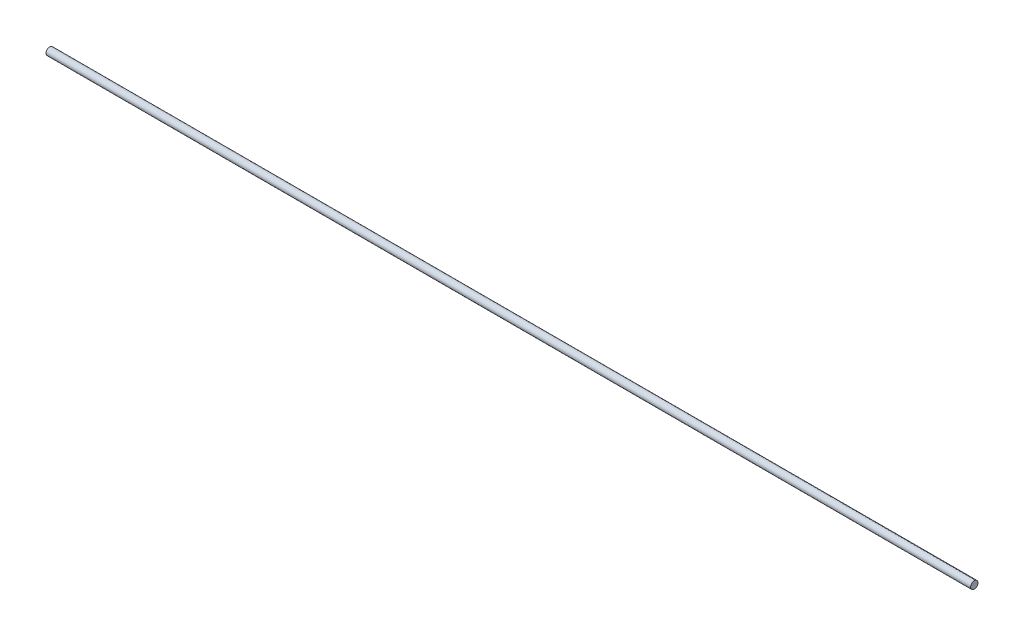
ISO-10303-21;
HEADER;
FILE_DESCRIPTION(('STEP AP214'),'2;1');
FILE_NAME('part.step','',(''),(''),'','','');
FILE_SCHEMA(('AUTOMOTIVE_DESIGN { 1 0 10303 214 1 1 1 1 }'));
ENDSEC;
DATA;
#1=APPLICATION_CONTEXT('core data for automotive mechanical design processes');
#2=APPLICATION_PROTOCOL_DEFINITION('international standard','automotive_design',2000,#1);
#3=PRODUCT_CONTEXT('',#1,'mechanical');
#4=PRODUCT('Part','Part','',(#3));
#5=PRODUCT_RELATED_PRODUCT_CATEGORY('part','',(#4));
#6=PRODUCT_DEFINITION_FORMATION('','',#4);
#7=PRODUCT_DEFINITION_CONTEXT('part definition',#1,'design');
#8=PRODUCT_DEFINITION('design','',#6,#7);
#9=PRODUCT_DEFINITION_SHAPE('','',#8);
#10=(LENGTH_UNIT() NAMED_UNIT(*) SI_UNIT(.MILLI.,.METRE.));
#11=(NAMED_UNIT(*) PLANE_ANGLE_UNIT() SI_UNIT($,.RADIAN.));
#12=(NAMED_UNIT(*) SI_UNIT($,.STERADIAN.) SOLID_ANGLE_UNIT());
#13=UNCERTAINTY_MEASURE_WITH_UNIT(LENGTH_MEASURE(1.E-05),#10,'distance_accuracy_value','');
#14=(GEOMETRIC_REPRESENTATION_CONTEXT(3) GLOBAL_UNCERTAINTY_ASSIGNED_CONTEXT((#13)) GLOBAL_UNIT_ASSIGNED_CONTEXT((#10,
#11,#12)) REPRESENTATION_CONTEXT('',''));
#15=CARTESIAN_POINT('',(0.,0.,0.));
#16=DIRECTION('',(0.,0.,1.));
#17=DIRECTION('',(1.,0.,0.));
#18=AXIS2_PLACEMENT_3D('',#15,#16,#17);
#19=CARTESIAN_POINT('',(500.,0.,0.));
#20=DIRECTION('',(-1.,0.,0.));
#21=DIRECTION('',(0.,0.,1.));
#22=AXIS2_PLACEMENT_3D('',#19,#20,#21);
#23=CYLINDRICAL_SURFACE('',#22,2.);
#24=CARTESIAN_POINT('',(500.,0.,0.));
#25=DIRECTION('',(1.,0.,0.));
#26=DIRECTION('',(0.,0.,-1.));
#27=AXIS2_PLACEMENT_3D('',#24,#25,#26);
#28=CIRCLE('',#27,2.);
#29=CARTESIAN_POINT('',(500.,0.,-2.));
#30=VERTEX_POINT('',#29);
#31=EDGE_CURVE('E10',#30,#30,#28,.T.);
#32=ORIENTED_EDGE('',*,*,#31,.F.);
#33=EDGE_LOOP('',(#32));
#34=FACE_BOUND('',#33,.T.);
#35=CARTESIAN_POINT('',(0.,0.,0.));
#36=DIRECTION('',(1.,0.,0.));
#37=DIRECTION('',(0.,0.,-1.));
#38=AXIS2_PLACEMENT_3D('',#35,#36,#37);
#39=CIRCLE('',#38,2.);
#40=CARTESIAN_POINT('',(0.,0.,-2.));
#41=VERTEX_POINT('',#40);
#42=EDGE_CURVE('E32',#41,#41,#39,.T.);
#43=ORIENTED_EDGE('',*,*,#42,.T.);
#44=EDGE_LOOP('',(#43));
#45=FACE_BOUND('',#44,.T.);
#46=ADVANCED_FACE('F26',(#34,#45),#23,.T.);
#47=CARTESIAN_POINT('',(500.,0.,0.));
#48=DIRECTION('',(1.,0.,0.));
#49=DIRECTION('',(0.,0.,-1.));
#50=AXIS2_PLACEMENT_3D('',#47,#48,#49);
#51=PLANE('',#50);
#52=ORIENTED_EDGE('',*,*,#31,.T.);
#53=EDGE_LOOP('',(#52));
#54=FACE_BOUND('',#53,.T.);
#55=ADVANCED_FACE('F41',(#54),#51,.T.);
#56=CARTESIAN_POINT('',(0.,0.,0.));
#57=DIRECTION('',(1.,0.,0.));
#58=DIRECTION('',(0.,0.,-1.));
#59=AXIS2_PLACEMENT_3D('',#56,#57,#58);
#60=PLANE('',#59);
#61=ORIENTED_EDGE('',*,*,#42,.F.);
#62=EDGE_LOOP('',(#61));
#63=FACE_BOUND('',#62,.T.);
#64=ADVANCED_FACE('F39',(#63),#60,.F.);
#65=CLOSED_SHELL('',(#46,#55,#64));
#66=MANIFOLD_SOLID_BREP('B2',#65);
#67=ADVANCED_BREP_SHAPE_REPRESENTATION('',(#18,#66),#14);
#68=SHAPE_DEFINITION_REPRESENTATION(#9,#67);
ENDSEC;
END-ISO-10303-21;
